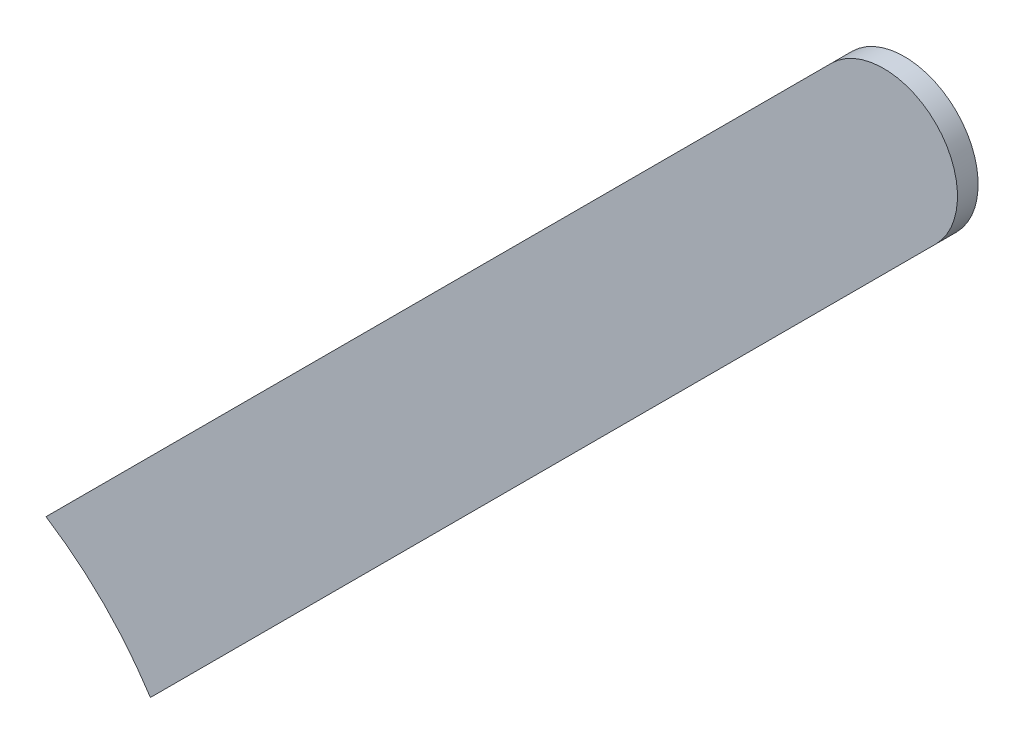
ISO-10303-21;
HEADER;
FILE_DESCRIPTION(('STEP AP214'),'2;1');
FILE_NAME('part.step','',(''),(''),'','','');
FILE_SCHEMA(('AUTOMOTIVE_DESIGN { 1 0 10303 214 1 1 1 1 }'));
ENDSEC;
DATA;
#1=APPLICATION_CONTEXT('core data for automotive mechanical design processes');
#2=APPLICATION_PROTOCOL_DEFINITION('international standard','automotive_design',2000,#1);
#3=PRODUCT_CONTEXT('',#1,'mechanical');
#4=PRODUCT('Part','Part','',(#3));
#5=PRODUCT_RELATED_PRODUCT_CATEGORY('part','',(#4));
#6=PRODUCT_DEFINITION_FORMATION('','',#4);
#7=PRODUCT_DEFINITION_CONTEXT('part definition',#1,'design');
#8=PRODUCT_DEFINITION('design','',#6,#7);
#9=PRODUCT_DEFINITION_SHAPE('','',#8);
#10=(LENGTH_UNIT() NAMED_UNIT(*) SI_UNIT(.MILLI.,.METRE.));
#11=(NAMED_UNIT(*) PLANE_ANGLE_UNIT() SI_UNIT($,.RADIAN.));
#12=(NAMED_UNIT(*) SI_UNIT($,.STERADIAN.) SOLID_ANGLE_UNIT());
#13=UNCERTAINTY_MEASURE_WITH_UNIT(LENGTH_MEASURE(1.E-05),#10,'distance_accuracy_value','');
#14=(GEOMETRIC_REPRESENTATION_CONTEXT(3) GLOBAL_UNCERTAINTY_ASSIGNED_CONTEXT((#13)) GLOBAL_UNIT_ASSIGNED_CONTEXT((#10,
#11,#12)) REPRESENTATION_CONTEXT('',''));
#15=CARTESIAN_POINT('',(0.,0.,0.));
#16=DIRECTION('',(0.,0.,1.));
#17=DIRECTION('',(1.,0.,0.));
#18=AXIS2_PLACEMENT_3D('',#15,#16,#17);
#19=CARTESIAN_POINT('',(82.5761605839932,103.945965443993,0.));
#20=DIRECTION('',(-0.707106781186545,0.70710678118655,0.));
#21=DIRECTION('',(0.70710678118655,0.707106781186545,0.));
#22=AXIS2_PLACEMENT_3D('',#19,#20,#21);
#23=PLANE('',#22);
#24=DIRECTION('',(0.70710678118655,0.707106781186545,0.));
#25=VECTOR('',#24,1.);
#26=CARTESIAN_POINT('',(82.16512904,103.5349339,0.03556));
#27=LINE('',#26,#25);
#28=CARTESIAN_POINT('',(82.5761605839932,103.945965443993,0.03556));
#29=VERTEX_POINT('',#28);
#30=CARTESIAN_POINT('',(83.92736326,105.29716812,0.03556));
#31=VERTEX_POINT('',#30);
#32=EDGE_CURVE('E11',#29,#31,#27,.T.);
#33=ORIENTED_EDGE('',*,*,#32,.F.);
#34=DIRECTION('',(0.,0.,1.));
#35=VECTOR('',#34,1.);
#36=CARTESIAN_POINT('',(82.5761605839932,103.945965443993,0.));
#37=LINE('',#36,#35);
#38=CARTESIAN_POINT('',(82.5761605839932,103.945965443993,0.));
#39=VERTEX_POINT('',#38);
#40=EDGE_CURVE('E24',#39,#29,#37,.T.);
#41=ORIENTED_EDGE('',*,*,#40,.F.);
#42=DIRECTION('',(0.70710678118655,0.707106781186545,0.));
#43=VECTOR('',#42,1.);
#44=CARTESIAN_POINT('',(82.16512904,103.5349339,0.));
#45=LINE('',#44,#43);
#46=CARTESIAN_POINT('',(83.92736326,105.29716812,0.));
#47=VERTEX_POINT('',#46);
#48=EDGE_CURVE('E75',#39,#47,#45,.T.);
#49=ORIENTED_EDGE('',*,*,#48,.T.);
#50=DIRECTION('',(0.,0.,1.));
#51=VECTOR('',#50,1.);
#52=CARTESIAN_POINT('',(83.92736326,105.29716812,0.));
#53=LINE('',#52,#51);
#54=EDGE_CURVE('E37',#47,#31,#53,.T.);
#55=ORIENTED_EDGE('',*,*,#54,.T.);
#56=EDGE_LOOP('',(#33,#41,#49,#55));
#57=FACE_BOUND('',#56,.T.);
#58=ADVANCED_FACE('F17',(#57),#23,.F.);
#59=CARTESIAN_POINT('',(83.83756029,105.38697109,0.));
#60=DIRECTION('',(0.,0.,-1.));
#61=DIRECTION('',(0.707106781186548,-0.707106781186548,0.));
#62=AXIS2_PLACEMENT_3D('',#59,#60,#61);
#63=CYLINDRICAL_SURFACE('',#62,0.127000578115386);
#64=CARTESIAN_POINT('',(83.83756029,105.38697109,0.03556));
#65=DIRECTION('',(0.,0.,1.));
#66=DIRECTION('',(0.707106781186548,-0.707106781186548,0.));
#67=AXIS2_PLACEMENT_3D('',#64,#65,#66);
#68=CIRCLE('',#67,0.127000578115386);
#69=CARTESIAN_POINT('',(83.74775732,105.47677406,0.03556));
#70=VERTEX_POINT('',#69);
#71=EDGE_CURVE('E83',#31,#70,#68,.T.);
#72=ORIENTED_EDGE('',*,*,#71,.F.);
#73=ORIENTED_EDGE('',*,*,#54,.F.);
#74=CARTESIAN_POINT('',(83.83756029,105.38697109,0.));
#75=DIRECTION('',(0.,0.,1.));
#76=DIRECTION('',(0.707106781186548,-0.707106781186548,0.));
#77=AXIS2_PLACEMENT_3D('',#74,#75,#76);
#78=CIRCLE('',#77,0.127000578115386);
#79=CARTESIAN_POINT('',(83.74775732,105.47677406,0.));
#80=VERTEX_POINT('',#79);
#81=EDGE_CURVE('E81',#47,#80,#78,.T.);
#82=ORIENTED_EDGE('',*,*,#81,.T.);
#83=DIRECTION('',(0.,0.,1.));
#84=VECTOR('',#83,1.);
#85=CARTESIAN_POINT('',(83.74775732,105.47677406,0.));
#86=LINE('',#85,#84);
#87=EDGE_CURVE('E67',#80,#70,#86,.T.);
#88=ORIENTED_EDGE('',*,*,#87,.T.);
#89=EDGE_LOOP('',(#72,#73,#82,#88));
#90=FACE_BOUND('',#89,.T.);
#91=ADVANCED_FACE('F89',(#90),#63,.T.);
#92=CARTESIAN_POINT('',(83.74775732,105.47677406,0.));
#93=DIRECTION('',(0.707106781186545,-0.70710678118655,0.));
#94=DIRECTION('',(-0.70710678118655,-0.707106781186545,0.));
#95=AXIS2_PLACEMENT_3D('',#92,#93,#94);
#96=PLANE('',#95);
#97=DIRECTION('',(-0.70710678118655,-0.707106781186545,0.));
#98=VECTOR('',#97,1.);
#99=CARTESIAN_POINT('',(83.74775732,105.47677406,0.03556));
#100=LINE('',#99,#98);
#101=CARTESIAN_POINT('',(82.3965546439932,104.125571383993,0.03556));
#102=VERTEX_POINT('',#101);
#103=EDGE_CURVE('E71',#70,#102,#100,.T.);
#104=ORIENTED_EDGE('',*,*,#103,.F.);
#105=ORIENTED_EDGE('',*,*,#87,.F.);
#106=DIRECTION('',(-0.70710678118655,-0.707106781186545,0.));
#107=VECTOR('',#106,1.);
#108=CARTESIAN_POINT('',(83.74775732,105.47677406,0.));
#109=LINE('',#108,#107);
#110=CARTESIAN_POINT('',(82.3965546439932,104.125571383993,0.));
#111=VERTEX_POINT('',#110);
#112=EDGE_CURVE('E63',#80,#111,#109,.T.);
#113=ORIENTED_EDGE('',*,*,#112,.T.);
#114=DIRECTION('',(0.,0.,1.));
#115=VECTOR('',#114,1.);
#116=CARTESIAN_POINT('',(82.3965546439932,104.125571383993,0.));
#117=LINE('',#116,#115);
#118=EDGE_CURVE('E53',#111,#102,#117,.T.);
#119=ORIENTED_EDGE('',*,*,#118,.T.);
#120=EDGE_LOOP('',(#104,#105,#113,#119));
#121=FACE_BOUND('',#120,.T.);
#122=ADVANCED_FACE('F66',(#121),#96,.F.);
#123=CARTESIAN_POINT('',(82.0753248,103.6247356,0.));
#124=DIRECTION('',(0.,0.,-1.));
#125=DIRECTION('',(1.,0.,0.));
#126=AXIS2_PLACEMENT_3D('',#123,#124,#125);
#127=CYLINDRICAL_SURFACE('',#126,0.59500008);
#128=ORIENTED_EDGE('',*,*,#40,.T.);
#129=CARTESIAN_POINT('',(82.0753248,103.6247356,0.03556));
#130=DIRECTION('',(0.,0.,1.));
#131=DIRECTION('',(1.,0.,0.));
#132=AXIS2_PLACEMENT_3D('',#129,#130,#131);
#133=CIRCLE('',#132,0.59500008);
#134=EDGE_CURVE('E59',#29,#102,#133,.T.);
#135=ORIENTED_EDGE('',*,*,#134,.T.);
#136=ORIENTED_EDGE('',*,*,#118,.F.);
#137=CARTESIAN_POINT('',(82.0753248,103.6247356,0.));
#138=DIRECTION('',(0.,0.,1.));
#139=DIRECTION('',(1.,0.,0.));
#140=AXIS2_PLACEMENT_3D('',#137,#138,#139);
#141=CIRCLE('',#140,0.59500008);
#142=EDGE_CURVE('E57',#39,#111,#141,.T.);
#143=ORIENTED_EDGE('',*,*,#142,.F.);
#144=EDGE_LOOP('',(#128,#135,#136,#143));
#145=FACE_BOUND('',#144,.T.);
#146=ADVANCED_FACE('F55',(#145),#127,.F.);
#147=CARTESIAN_POINT('',(82.16512904,103.5349339,0.));
#148=DIRECTION('',(0.,0.,-1.));
#149=DIRECTION('',(-1.,0.,0.));
#150=AXIS2_PLACEMENT_3D('',#147,#148,#149);
#151=PLANE('',#150);
#152=ORIENTED_EDGE('',*,*,#48,.F.);
#153=ORIENTED_EDGE('',*,*,#142,.T.);
#154=ORIENTED_EDGE('',*,*,#112,.F.);
#155=ORIENTED_EDGE('',*,*,#81,.F.);
#156=EDGE_LOOP('',(#152,#153,#154,#155));
#157=FACE_BOUND('',#156,.T.);
#158=ADVANCED_FACE('F74',(#157),#151,.T.);
#159=CARTESIAN_POINT('',(82.16512904,103.5349339,0.03556));
#160=DIRECTION('',(0.,0.,-1.));
#161=DIRECTION('',(-1.,0.,0.));
#162=AXIS2_PLACEMENT_3D('',#159,#160,#161);
#163=PLANE('',#162);
#164=ORIENTED_EDGE('',*,*,#134,.F.);
#165=ORIENTED_EDGE('',*,*,#32,.T.);
#166=ORIENTED_EDGE('',*,*,#71,.T.);
#167=ORIENTED_EDGE('',*,*,#103,.T.);
#168=EDGE_LOOP('',(#164,#165,#166,#167));
#169=FACE_BOUND('',#168,.T.);
#170=ADVANCED_FACE('F91',(#169),#163,.F.);
#171=CLOSED_SHELL('',(#58,#91,#122,#146,#158,#170));
#172=MANIFOLD_SOLID_BREP('B1',#171);
#173=ADVANCED_BREP_SHAPE_REPRESENTATION('',(#18,#172),#14);
#174=SHAPE_DEFINITION_REPRESENTATION(#9,#173);
ENDSEC;
END-ISO-10303-21;
